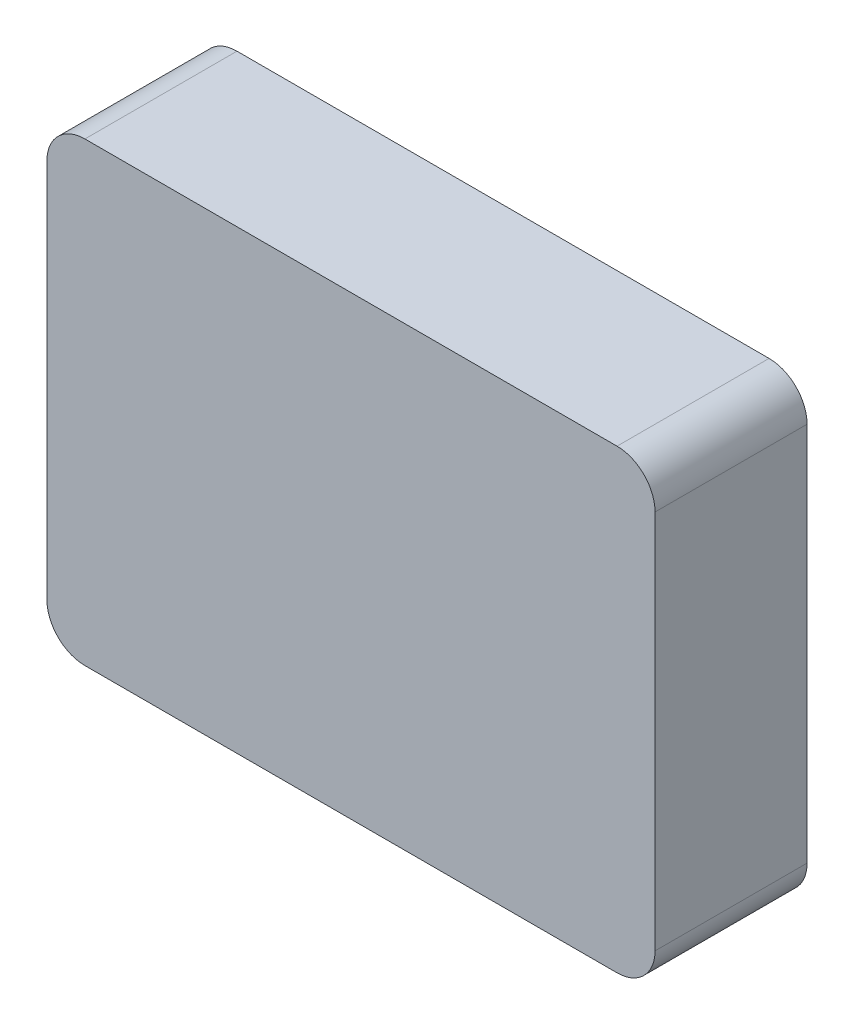
ISO-10303-21;
HEADER;
FILE_DESCRIPTION(('STEP AP214'),'2;1');
FILE_NAME('part.step','',(''),(''),'','','');
FILE_SCHEMA(('AUTOMOTIVE_DESIGN { 1 0 10303 214 1 1 1 1 }'));
ENDSEC;
DATA;
#1=APPLICATION_CONTEXT('core data for automotive mechanical design processes');
#2=APPLICATION_PROTOCOL_DEFINITION('international standard','automotive_design',2000,#1);
#3=PRODUCT_CONTEXT('',#1,'mechanical');
#4=PRODUCT('Part','Part','',(#3));
#5=PRODUCT_RELATED_PRODUCT_CATEGORY('part','',(#4));
#6=PRODUCT_DEFINITION_FORMATION('','',#4);
#7=PRODUCT_DEFINITION_CONTEXT('part definition',#1,'design');
#8=PRODUCT_DEFINITION('design','',#6,#7);
#9=PRODUCT_DEFINITION_SHAPE('','',#8);
#10=(LENGTH_UNIT() NAMED_UNIT(*) SI_UNIT(.MILLI.,.METRE.));
#11=(NAMED_UNIT(*) PLANE_ANGLE_UNIT() SI_UNIT($,.RADIAN.));
#12=(NAMED_UNIT(*) SI_UNIT($,.STERADIAN.) SOLID_ANGLE_UNIT());
#13=UNCERTAINTY_MEASURE_WITH_UNIT(LENGTH_MEASURE(1.E-05),#10,'distance_accuracy_value','');
#14=(GEOMETRIC_REPRESENTATION_CONTEXT(3) GLOBAL_UNCERTAINTY_ASSIGNED_CONTEXT((#13)) GLOBAL_UNIT_ASSIGNED_CONTEXT((#10,
#11,#12)) REPRESENTATION_CONTEXT('',''));
#15=CARTESIAN_POINT('',(0.,0.,0.));
#16=DIRECTION('',(0.,0.,1.));
#17=DIRECTION('',(1.,0.,0.));
#18=AXIS2_PLACEMENT_3D('',#15,#16,#17);
#19=CARTESIAN_POINT('',(0.,0.,8.));
#20=DIRECTION('',(1.,0.,0.));
#21=DIRECTION('',(0.,1.,0.));
#22=AXIS2_PLACEMENT_3D('',#19,#20,#21);
#23=PLANE('',#22);
#24=DIRECTION('',(0.,-1.,0.));
#25=VECTOR('',#24,1.);
#26=CARTESIAN_POINT('',(0.,0.,0.));
#27=LINE('',#26,#25);
#28=CARTESIAN_POINT('',(0.,-2.,0.));
#29=VERTEX_POINT('',#28);
#30=CARTESIAN_POINT('',(0.,-22.,0.));
#31=VERTEX_POINT('',#30);
#32=EDGE_CURVE('E130',#29,#31,#27,.T.);
#33=ORIENTED_EDGE('',*,*,#32,.T.);
#34=DIRECTION('',(0.,0.,-1.));
#35=VECTOR('',#34,1.);
#36=CARTESIAN_POINT('',(0.,-22.,8.));
#37=LINE('',#36,#35);
#38=CARTESIAN_POINT('',(0.,-22.,8.));
#39=VERTEX_POINT('',#38);
#40=EDGE_CURVE('E152',#31,#39,#37,.F.);
#41=ORIENTED_EDGE('',*,*,#40,.T.);
#42=DIRECTION('',(0.,-1.,0.));
#43=VECTOR('',#42,1.);
#44=CARTESIAN_POINT('',(0.,0.,8.));
#45=LINE('',#44,#43);
#46=CARTESIAN_POINT('',(0.,-2.,8.));
#47=VERTEX_POINT('',#46);
#48=EDGE_CURVE('E128',#47,#39,#45,.T.);
#49=ORIENTED_EDGE('',*,*,#48,.F.);
#50=DIRECTION('',(0.,0.,-1.));
#51=VECTOR('',#50,1.);
#52=CARTESIAN_POINT('',(0.,-2.,8.));
#53=LINE('',#52,#51);
#54=EDGE_CURVE('E149',#47,#29,#53,.T.);
#55=ORIENTED_EDGE('',*,*,#54,.T.);
#56=EDGE_LOOP('',(#33,#41,#49,#55));
#57=FACE_BOUND('',#56,.T.);
#58=ADVANCED_FACE('F33',(#57),#23,.F.);
#59=CARTESIAN_POINT('',(0.,-24.,8.));
#60=DIRECTION('',(0.,1.,0.));
#61=DIRECTION('',(0.,0.,1.));
#62=AXIS2_PLACEMENT_3D('',#59,#60,#61);
#63=PLANE('',#62);
#64=DIRECTION('',(1.,0.,0.));
#65=VECTOR('',#64,1.);
#66=CARTESIAN_POINT('',(0.,-24.,0.));
#67=LINE('',#66,#65);
#68=CARTESIAN_POINT('',(2.,-24.,0.));
#69=VERTEX_POINT('',#68);
#70=CARTESIAN_POINT('',(30.,-24.,0.));
#71=VERTEX_POINT('',#70);
#72=EDGE_CURVE('E126',#69,#71,#67,.T.);
#73=ORIENTED_EDGE('',*,*,#72,.T.);
#74=DIRECTION('',(0.,0.,-1.));
#75=VECTOR('',#74,1.);
#76=CARTESIAN_POINT('',(30.,-24.,8.));
#77=LINE('',#76,#75);
#78=CARTESIAN_POINT('',(30.,-24.,8.));
#79=VERTEX_POINT('',#78);
#80=EDGE_CURVE('E104',#71,#79,#77,.F.);
#81=ORIENTED_EDGE('',*,*,#80,.T.);
#82=DIRECTION('',(1.,0.,0.));
#83=VECTOR('',#82,1.);
#84=CARTESIAN_POINT('',(0.,-24.,8.));
#85=LINE('',#84,#83);
#86=CARTESIAN_POINT('',(2.,-24.,8.));
#87=VERTEX_POINT('',#86);
#88=EDGE_CURVE('E166',#87,#79,#85,.T.);
#89=ORIENTED_EDGE('',*,*,#88,.F.);
#90=DIRECTION('',(0.,0.,-1.));
#91=VECTOR('',#90,1.);
#92=CARTESIAN_POINT('',(2.,-24.,8.));
#93=LINE('',#92,#91);
#94=EDGE_CURVE('E109',#87,#69,#93,.T.);
#95=ORIENTED_EDGE('',*,*,#94,.T.);
#96=EDGE_LOOP('',(#73,#81,#89,#95));
#97=FACE_BOUND('',#96,.T.);
#98=ADVANCED_FACE('F171',(#97),#63,.F.);
#99=CARTESIAN_POINT('',(32.,0.,8.));
#100=DIRECTION('',(-1.,0.,0.));
#101=DIRECTION('',(0.,0.,1.));
#102=AXIS2_PLACEMENT_3D('',#99,#100,#101);
#103=PLANE('',#102);
#104=DIRECTION('',(0.,1.,0.));
#105=VECTOR('',#104,1.);
#106=CARTESIAN_POINT('',(32.,0.,8.));
#107=LINE('',#106,#105);
#108=CARTESIAN_POINT('',(32.,-22.,8.));
#109=VERTEX_POINT('',#108);
#110=CARTESIAN_POINT('',(32.,-2.,8.));
#111=VERTEX_POINT('',#110);
#112=EDGE_CURVE('E118',#109,#111,#107,.T.);
#113=ORIENTED_EDGE('',*,*,#112,.F.);
#114=DIRECTION('',(0.,0.,-1.));
#115=VECTOR('',#114,1.);
#116=CARTESIAN_POINT('',(32.,-22.,8.));
#117=LINE('',#116,#115);
#118=CARTESIAN_POINT('',(32.,-22.,0.));
#119=VERTEX_POINT('',#118);
#120=EDGE_CURVE('E103',#109,#119,#117,.T.);
#121=ORIENTED_EDGE('',*,*,#120,.T.);
#122=DIRECTION('',(0.,1.,0.));
#123=VECTOR('',#122,1.);
#124=CARTESIAN_POINT('',(32.,0.,0.));
#125=LINE('',#124,#123);
#126=CARTESIAN_POINT('',(32.,-2.,0.));
#127=VERTEX_POINT('',#126);
#128=EDGE_CURVE('E116',#119,#127,#125,.T.);
#129=ORIENTED_EDGE('',*,*,#128,.T.);
#130=DIRECTION('',(0.,0.,-1.));
#131=VECTOR('',#130,1.);
#132=CARTESIAN_POINT('',(32.,-2.,8.));
#133=LINE('',#132,#131);
#134=EDGE_CURVE('E120',#127,#111,#133,.F.);
#135=ORIENTED_EDGE('',*,*,#134,.T.);
#136=EDGE_LOOP('',(#113,#121,#129,#135));
#137=FACE_BOUND('',#136,.T.);
#138=ADVANCED_FACE('F115',(#137),#103,.F.);
#139=CARTESIAN_POINT('',(0.,0.,8.));
#140=DIRECTION('',(0.,-1.,0.));
#141=DIRECTION('',(0.,0.,-1.));
#142=AXIS2_PLACEMENT_3D('',#139,#140,#141);
#143=PLANE('',#142);
#144=DIRECTION('',(-1.,0.,0.));
#145=VECTOR('',#144,1.);
#146=CARTESIAN_POINT('',(0.,0.,8.));
#147=LINE('',#146,#145);
#148=CARTESIAN_POINT('',(30.,0.,8.));
#149=VERTEX_POINT('',#148);
#150=CARTESIAN_POINT('',(2.,0.,8.));
#151=VERTEX_POINT('',#150);
#152=EDGE_CURVE('E134',#149,#151,#147,.T.);
#153=ORIENTED_EDGE('',*,*,#152,.F.);
#154=DIRECTION('',(0.,0.,-1.));
#155=VECTOR('',#154,1.);
#156=CARTESIAN_POINT('',(30.,0.,8.));
#157=LINE('',#156,#155);
#158=CARTESIAN_POINT('',(30.,0.,0.));
#159=VERTEX_POINT('',#158);
#160=EDGE_CURVE('E11',#149,#159,#157,.T.);
#161=ORIENTED_EDGE('',*,*,#160,.T.);
#162=DIRECTION('',(-1.,0.,0.));
#163=VECTOR('',#162,1.);
#164=CARTESIAN_POINT('',(0.,0.,0.));
#165=LINE('',#164,#163);
#166=CARTESIAN_POINT('',(2.,0.,0.));
#167=VERTEX_POINT('',#166);
#168=EDGE_CURVE('E125',#159,#167,#165,.T.);
#169=ORIENTED_EDGE('',*,*,#168,.T.);
#170=DIRECTION('',(0.,0.,-1.));
#171=VECTOR('',#170,1.);
#172=CARTESIAN_POINT('',(2.,0.,8.));
#173=LINE('',#172,#171);
#174=EDGE_CURVE('E41',#167,#151,#173,.F.);
#175=ORIENTED_EDGE('',*,*,#174,.T.);
#176=EDGE_LOOP('',(#153,#161,#169,#175));
#177=FACE_BOUND('',#176,.T.);
#178=ADVANCED_FACE('F178',(#177),#143,.F.);
#179=CARTESIAN_POINT('',(0.,0.,8.));
#180=DIRECTION('',(0.,0.,1.));
#181=DIRECTION('',(1.,0.,0.));
#182=AXIS2_PLACEMENT_3D('',#179,#180,#181);
#183=PLANE('',#182);
#184=ORIENTED_EDGE('',*,*,#88,.T.);
#185=CARTESIAN_POINT('',(30.,-22.,8.));
#186=DIRECTION('',(0.,0.,1.));
#187=DIRECTION('',(1.,0.,0.));
#188=AXIS2_PLACEMENT_3D('',#185,#186,#187);
#189=CIRCLE('',#188,2.);
#190=EDGE_CURVE('E147',#79,#109,#189,.T.);
#191=ORIENTED_EDGE('',*,*,#190,.T.);
#192=ORIENTED_EDGE('',*,*,#112,.T.);
#193=CARTESIAN_POINT('',(30.,-2.,8.));
#194=DIRECTION('',(0.,0.,1.));
#195=DIRECTION('',(1.,0.,0.));
#196=AXIS2_PLACEMENT_3D('',#193,#194,#195);
#197=CIRCLE('',#196,2.);
#198=EDGE_CURVE('E54',#111,#149,#197,.T.);
#199=ORIENTED_EDGE('',*,*,#198,.T.);
#200=ORIENTED_EDGE('',*,*,#152,.T.);
#201=CARTESIAN_POINT('',(2.,-2.,8.));
#202=DIRECTION('',(0.,0.,1.));
#203=DIRECTION('',(1.,0.,0.));
#204=AXIS2_PLACEMENT_3D('',#201,#202,#203);
#205=CIRCLE('',#204,2.);
#206=EDGE_CURVE('E142',#151,#47,#205,.T.);
#207=ORIENTED_EDGE('',*,*,#206,.T.);
#208=ORIENTED_EDGE('',*,*,#48,.T.);
#209=CARTESIAN_POINT('',(2.,-22.,8.));
#210=DIRECTION('',(0.,0.,1.));
#211=DIRECTION('',(1.,0.,0.));
#212=AXIS2_PLACEMENT_3D('',#209,#210,#211);
#213=CIRCLE('',#212,2.);
#214=EDGE_CURVE('E145',#39,#87,#213,.T.);
#215=ORIENTED_EDGE('',*,*,#214,.T.);
#216=EDGE_LOOP('',(#184,#191,#192,#199,#200,#207,#208,#215));
#217=FACE_BOUND('',#216,.T.);
#218=ADVANCED_FACE('F163',(#217),#183,.T.);
#219=CARTESIAN_POINT('',(0.,0.,0.));
#220=DIRECTION('',(0.,0.,1.));
#221=DIRECTION('',(1.,0.,0.));
#222=AXIS2_PLACEMENT_3D('',#219,#220,#221);
#223=PLANE('',#222);
#224=ORIENTED_EDGE('',*,*,#128,.F.);
#225=CARTESIAN_POINT('',(30.,-22.,0.));
#226=DIRECTION('',(0.,0.,1.));
#227=DIRECTION('',(1.,0.,0.));
#228=AXIS2_PLACEMENT_3D('',#225,#226,#227);
#229=CIRCLE('',#228,2.);
#230=EDGE_CURVE('E99',#119,#71,#229,.F.);
#231=ORIENTED_EDGE('',*,*,#230,.T.);
#232=ORIENTED_EDGE('',*,*,#72,.F.);
#233=CARTESIAN_POINT('',(2.,-22.,0.));
#234=DIRECTION('',(0.,0.,1.));
#235=DIRECTION('',(1.,0.,0.));
#236=AXIS2_PLACEMENT_3D('',#233,#234,#235);
#237=CIRCLE('',#236,2.);
#238=EDGE_CURVE('E110',#69,#31,#237,.F.);
#239=ORIENTED_EDGE('',*,*,#238,.T.);
#240=ORIENTED_EDGE('',*,*,#32,.F.);
#241=CARTESIAN_POINT('',(2.,-2.,0.));
#242=DIRECTION('',(0.,0.,1.));
#243=DIRECTION('',(1.,0.,0.));
#244=AXIS2_PLACEMENT_3D('',#241,#242,#243);
#245=CIRCLE('',#244,2.);
#246=EDGE_CURVE('E119',#29,#167,#245,.F.);
#247=ORIENTED_EDGE('',*,*,#246,.T.);
#248=ORIENTED_EDGE('',*,*,#168,.F.);
#249=CARTESIAN_POINT('',(30.,-2.,0.));
#250=DIRECTION('',(0.,0.,1.));
#251=DIRECTION('',(1.,0.,0.));
#252=AXIS2_PLACEMENT_3D('',#249,#250,#251);
#253=CIRCLE('',#252,2.);
#254=EDGE_CURVE('E124',#159,#127,#253,.F.);
#255=ORIENTED_EDGE('',*,*,#254,.T.);
#256=EDGE_LOOP('',(#224,#231,#232,#239,#240,#247,#248,#255));
#257=FACE_BOUND('',#256,.T.);
#258=ADVANCED_FACE('F122',(#257),#223,.F.);
#259=CARTESIAN_POINT('',(30.,-22.,8.));
#260=DIRECTION('',(0.,0.,-1.));
#261=DIRECTION('',(-1.,0.,0.));
#262=AXIS2_PLACEMENT_3D('',#259,#260,#261);
#263=CYLINDRICAL_SURFACE('',#262,2.);
#264=ORIENTED_EDGE('',*,*,#190,.F.);
#265=ORIENTED_EDGE('',*,*,#80,.F.);
#266=ORIENTED_EDGE('',*,*,#230,.F.);
#267=ORIENTED_EDGE('',*,*,#120,.F.);
#268=EDGE_LOOP('',(#264,#265,#266,#267));
#269=FACE_BOUND('',#268,.T.);
#270=ADVANCED_FACE('F102',(#269),#263,.T.);
#271=CARTESIAN_POINT('',(2.,-22.,8.));
#272=DIRECTION('',(0.,0.,-1.));
#273=DIRECTION('',(-1.,0.,0.));
#274=AXIS2_PLACEMENT_3D('',#271,#272,#273);
#275=CYLINDRICAL_SURFACE('',#274,2.);
#276=ORIENTED_EDGE('',*,*,#214,.F.);
#277=ORIENTED_EDGE('',*,*,#40,.F.);
#278=ORIENTED_EDGE('',*,*,#238,.F.);
#279=ORIENTED_EDGE('',*,*,#94,.F.);
#280=EDGE_LOOP('',(#276,#277,#278,#279));
#281=FACE_BOUND('',#280,.T.);
#282=ADVANCED_FACE('F169',(#281),#275,.T.);
#283=CARTESIAN_POINT('',(30.,-2.,8.));
#284=DIRECTION('',(0.,0.,-1.));
#285=DIRECTION('',(-1.,0.,0.));
#286=AXIS2_PLACEMENT_3D('',#283,#284,#285);
#287=CYLINDRICAL_SURFACE('',#286,2.);
#288=ORIENTED_EDGE('',*,*,#198,.F.);
#289=ORIENTED_EDGE('',*,*,#134,.F.);
#290=ORIENTED_EDGE('',*,*,#254,.F.);
#291=ORIENTED_EDGE('',*,*,#160,.F.);
#292=EDGE_LOOP('',(#288,#289,#290,#291));
#293=FACE_BOUND('',#292,.T.);
#294=ADVANCED_FACE('F177',(#293),#287,.T.);
#295=CARTESIAN_POINT('',(2.,-2.,8.));
#296=DIRECTION('',(0.,0.,-1.));
#297=DIRECTION('',(-1.,0.,0.));
#298=AXIS2_PLACEMENT_3D('',#295,#296,#297);
#299=CYLINDRICAL_SURFACE('',#298,2.);
#300=ORIENTED_EDGE('',*,*,#206,.F.);
#301=ORIENTED_EDGE('',*,*,#174,.F.);
#302=ORIENTED_EDGE('',*,*,#246,.F.);
#303=ORIENTED_EDGE('',*,*,#54,.F.);
#304=EDGE_LOOP('',(#300,#301,#302,#303));
#305=FACE_BOUND('',#304,.T.);
#306=ADVANCED_FACE('F35',(#305),#299,.T.);
#307=CLOSED_SHELL('',(#58,#98,#138,#178,#218,#258,#270,#282,#294,#306));
#308=MANIFOLD_SOLID_BREP('B2',#307);
#309=ADVANCED_BREP_SHAPE_REPRESENTATION('',(#18,#308),#14);
#310=SHAPE_DEFINITION_REPRESENTATION(#9,#309);
ENDSEC;
END-ISO-10303-21;
